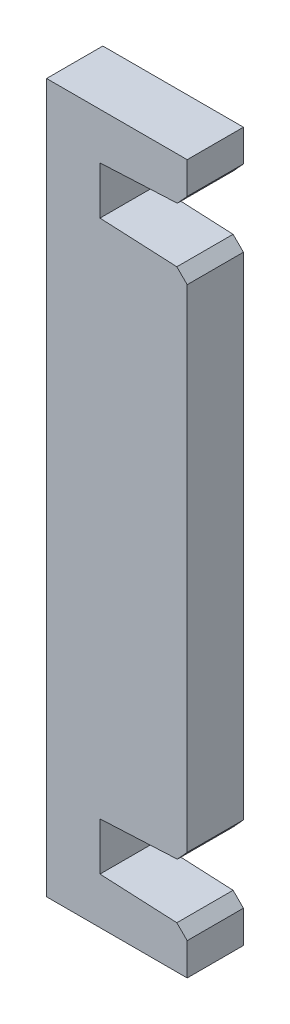
ISO-10303-21;
HEADER;
FILE_DESCRIPTION(('STEP AP214'),'2;1');
FILE_NAME('part.step','',(''),(''),'','','');
FILE_SCHEMA(('AUTOMOTIVE_DESIGN { 1 0 10303 214 1 1 1 1 }'));
ENDSEC;
DATA;
#1=APPLICATION_CONTEXT('core data for automotive mechanical design processes');
#2=APPLICATION_PROTOCOL_DEFINITION('international standard','automotive_design',2000,#1);
#3=PRODUCT_CONTEXT('',#1,'mechanical');
#4=PRODUCT('Part','Part','',(#3));
#5=PRODUCT_RELATED_PRODUCT_CATEGORY('part','',(#4));
#6=PRODUCT_DEFINITION_FORMATION('','',#4);
#7=PRODUCT_DEFINITION_CONTEXT('part definition',#1,'design');
#8=PRODUCT_DEFINITION('design','',#6,#7);
#9=PRODUCT_DEFINITION_SHAPE('','',#8);
#10=(LENGTH_UNIT() NAMED_UNIT(*) SI_UNIT(.MILLI.,.METRE.));
#11=(NAMED_UNIT(*) PLANE_ANGLE_UNIT() SI_UNIT($,.RADIAN.));
#12=(NAMED_UNIT(*) SI_UNIT($,.STERADIAN.) SOLID_ANGLE_UNIT());
#13=UNCERTAINTY_MEASURE_WITH_UNIT(LENGTH_MEASURE(1.E-05),#10,'distance_accuracy_value','');
#14=(GEOMETRIC_REPRESENTATION_CONTEXT(3) GLOBAL_UNCERTAINTY_ASSIGNED_CONTEXT((#13)) GLOBAL_UNIT_ASSIGNED_CONTEXT((#10,
#11,#12)) REPRESENTATION_CONTEXT('',''));
#15=CARTESIAN_POINT('',(0.,0.,0.));
#16=DIRECTION('',(0.,0.,1.));
#17=DIRECTION('',(1.,0.,0.));
#18=AXIS2_PLACEMENT_3D('',#15,#16,#17);
#19=CARTESIAN_POINT('',(-10.,0.,4.));
#20=DIRECTION('',(1.,0.,0.));
#21=DIRECTION('',(0.,0.,-1.));
#22=AXIS2_PLACEMENT_3D('',#19,#20,#21);
#23=PLANE('',#22);
#24=DIRECTION('',(0.,-1.,0.));
#25=VECTOR('',#24,1.);
#26=CARTESIAN_POINT('',(-10.,0.,0.));
#27=LINE('',#26,#25);
#28=CARTESIAN_POINT('',(-10.,25.2,0.));
#29=VERTEX_POINT('',#28);
#30=CARTESIAN_POINT('',(-10.,-25.2,0.));
#31=VERTEX_POINT('',#30);
#32=EDGE_CURVE('E180',#29,#31,#27,.T.);
#33=ORIENTED_EDGE('',*,*,#32,.T.);
#34=DIRECTION('',(0.,0.,-1.));
#35=VECTOR('',#34,1.);
#36=CARTESIAN_POINT('',(-10.,-25.2,4.));
#37=LINE('',#36,#35);
#38=CARTESIAN_POINT('',(-10.,-25.2,4.));
#39=VERTEX_POINT('',#38);
#40=EDGE_CURVE('E178',#39,#31,#37,.T.);
#41=ORIENTED_EDGE('',*,*,#40,.F.);
#42=DIRECTION('',(0.,-1.,0.));
#43=VECTOR('',#42,1.);
#44=CARTESIAN_POINT('',(-10.,0.,4.));
#45=LINE('',#44,#43);
#46=CARTESIAN_POINT('',(-10.,25.2,4.));
#47=VERTEX_POINT('',#46);
#48=EDGE_CURVE('E162',#47,#39,#45,.T.);
#49=ORIENTED_EDGE('',*,*,#48,.F.);
#50=DIRECTION('',(0.,0.,-1.));
#51=VECTOR('',#50,1.);
#52=CARTESIAN_POINT('',(-10.,25.2,4.));
#53=LINE('',#52,#51);
#54=EDGE_CURVE('E229',#47,#29,#53,.T.);
#55=ORIENTED_EDGE('',*,*,#54,.T.);
#56=EDGE_LOOP('',(#33,#41,#49,#55));
#57=FACE_BOUND('',#56,.T.);
#58=ADVANCED_FACE('F48',(#57),#23,.F.);
#59=CARTESIAN_POINT('',(0.,-25.2,4.));
#60=DIRECTION('',(0.,-1.,0.));
#61=DIRECTION('',(0.,0.,-1.));
#62=AXIS2_PLACEMENT_3D('',#59,#60,#61);
#63=PLANE('',#62);
#64=DIRECTION('',(-1.,0.,0.));
#65=VECTOR('',#64,1.);
#66=CARTESIAN_POINT('',(0.,-25.2,0.));
#67=LINE('',#66,#65);
#68=CARTESIAN_POINT('',(0.,-25.2,0.));
#69=VERTEX_POINT('',#68);
#70=EDGE_CURVE('E232',#69,#31,#67,.T.);
#71=ORIENTED_EDGE('',*,*,#70,.F.);
#72=DIRECTION('',(0.,0.,-1.));
#73=VECTOR('',#72,1.);
#74=CARTESIAN_POINT('',(0.,-25.2,4.));
#75=LINE('',#74,#73);
#76=CARTESIAN_POINT('',(0.,-25.2,4.));
#77=VERTEX_POINT('',#76);
#78=EDGE_CURVE('E186',#77,#69,#75,.T.);
#79=ORIENTED_EDGE('',*,*,#78,.F.);
#80=DIRECTION('',(-1.,0.,0.));
#81=VECTOR('',#80,1.);
#82=CARTESIAN_POINT('',(0.,-25.2,4.));
#83=LINE('',#82,#81);
#84=EDGE_CURVE('E168',#77,#39,#83,.T.);
#85=ORIENTED_EDGE('',*,*,#84,.T.);
#86=ORIENTED_EDGE('',*,*,#40,.T.);
#87=EDGE_LOOP('',(#71,#79,#85,#86));
#88=FACE_BOUND('',#87,.T.);
#89=ADVANCED_FACE('F189',(#88),#63,.T.);
#90=CARTESIAN_POINT('',(0.,0.,4.));
#91=DIRECTION('',(1.,0.,0.));
#92=DIRECTION('',(0.,1.,0.));
#93=AXIS2_PLACEMENT_3D('',#90,#91,#92);
#94=PLANE('',#93);
#95=DIRECTION('',(0.,-1.,0.));
#96=VECTOR('',#95,1.);
#97=CARTESIAN_POINT('',(0.,0.,0.));
#98=LINE('',#97,#96);
#99=CARTESIAN_POINT('',(0.,-22.9,0.));
#100=VERTEX_POINT('',#99);
#101=EDGE_CURVE('E235',#100,#69,#98,.T.);
#102=ORIENTED_EDGE('',*,*,#101,.F.);
#103=DIRECTION('',(0.,0.,1.));
#104=VECTOR('',#103,1.);
#105=CARTESIAN_POINT('',(0.,-22.9,4.));
#106=LINE('',#105,#104);
#107=CARTESIAN_POINT('',(0.,-22.9,4.));
#108=VERTEX_POINT('',#107);
#109=EDGE_CURVE('E324',#100,#108,#106,.T.);
#110=ORIENTED_EDGE('',*,*,#109,.T.);
#111=DIRECTION('',(0.,-1.,0.));
#112=VECTOR('',#111,1.);
#113=CARTESIAN_POINT('',(0.,0.,4.));
#114=LINE('',#113,#112);
#115=EDGE_CURVE('E192',#108,#77,#114,.T.);
#116=ORIENTED_EDGE('',*,*,#115,.T.);
#117=ORIENTED_EDGE('',*,*,#78,.T.);
#118=EDGE_LOOP('',(#102,#110,#116,#117));
#119=FACE_BOUND('',#118,.T.);
#120=ADVANCED_FACE('F361',(#119),#94,.T.);
#121=CARTESIAN_POINT('',(-1.07168440176485,-22.1481443031404,4.));
#122=DIRECTION('',(0.0483305514233223,0.998831396082,0.));
#123=DIRECTION('',(-0.998831396082,0.0483305514233223,0.));
#124=AXIS2_PLACEMENT_3D('',#121,#122,#123);
#125=PLANE('',#124);
#126=DIRECTION('',(0.998831396082,-0.0483305514233223,0.));
#127=VECTOR('',#126,1.);
#128=CARTESIAN_POINT('',(-1.07168440176485,-22.1481443031404,4.));
#129=LINE('',#128,#127);
#130=CARTESIAN_POINT('',(-6.20000000000001,-21.9,4.));
#131=VERTEX_POINT('',#130);
#132=CARTESIAN_POINT('',(-0.735593220338887,-22.164406779661,4.));
#133=VERTEX_POINT('',#132);
#134=EDGE_CURVE('E198',#131,#133,#129,.T.);
#135=ORIENTED_EDGE('',*,*,#134,.T.);
#136=DIRECTION('',(0.,0.,-1.));
#137=VECTOR('',#136,1.);
#138=CARTESIAN_POINT('',(-0.735593220338887,-22.164406779661,4.));
#139=LINE('',#138,#137);
#140=CARTESIAN_POINT('',(-0.735593220338887,-22.164406779661,0.));
#141=VERTEX_POINT('',#140);
#142=EDGE_CURVE('E320',#133,#141,#139,.T.);
#143=ORIENTED_EDGE('',*,*,#142,.T.);
#144=DIRECTION('',(0.998831396082,-0.0483305514233223,0.));
#145=VECTOR('',#144,1.);
#146=CARTESIAN_POINT('',(-1.07168440176485,-22.1481443031404,0.));
#147=LINE('',#146,#145);
#148=CARTESIAN_POINT('',(-6.20000000000001,-21.9,0.));
#149=VERTEX_POINT('',#148);
#150=EDGE_CURVE('E238',#149,#141,#147,.T.);
#151=ORIENTED_EDGE('',*,*,#150,.F.);
#152=DIRECTION('',(0.,0.,-1.));
#153=VECTOR('',#152,1.);
#154=CARTESIAN_POINT('',(-6.20000000000001,-21.9,4.));
#155=LINE('',#154,#153);
#156=EDGE_CURVE('E284',#131,#149,#155,.T.);
#157=ORIENTED_EDGE('',*,*,#156,.F.);
#158=EDGE_LOOP('',(#135,#143,#151,#157));
#159=FACE_BOUND('',#158,.T.);
#160=ADVANCED_FACE('F417',(#159),#125,.T.);
#161=CARTESIAN_POINT('',(-6.19999999999992,0.,4.));
#162=DIRECTION('',(1.,0.,0.));
#163=DIRECTION('',(0.,1.,0.));
#164=AXIS2_PLACEMENT_3D('',#161,#162,#163);
#165=PLANE('',#164);
#166=DIRECTION('',(0.,-1.,0.));
#167=VECTOR('',#166,1.);
#168=CARTESIAN_POINT('',(-6.19999999999992,0.,0.));
#169=LINE('',#168,#167);
#170=CARTESIAN_POINT('',(-6.2,-18.5,0.));
#171=VERTEX_POINT('',#170);
#172=EDGE_CURVE('E242',#171,#149,#169,.T.);
#173=ORIENTED_EDGE('',*,*,#172,.F.);
#174=DIRECTION('',(0.,0.,-1.));
#175=VECTOR('',#174,1.);
#176=CARTESIAN_POINT('',(-6.2,-18.5,4.));
#177=LINE('',#176,#175);
#178=CARTESIAN_POINT('',(-6.2,-18.5,4.));
#179=VERTEX_POINT('',#178);
#180=EDGE_CURVE('E280',#179,#171,#177,.T.);
#181=ORIENTED_EDGE('',*,*,#180,.F.);
#182=DIRECTION('',(0.,-1.,0.));
#183=VECTOR('',#182,1.);
#184=CARTESIAN_POINT('',(-6.19999999999992,0.,4.));
#185=LINE('',#184,#183);
#186=EDGE_CURVE('E204',#179,#131,#185,.T.);
#187=ORIENTED_EDGE('',*,*,#186,.T.);
#188=ORIENTED_EDGE('',*,*,#156,.T.);
#189=EDGE_LOOP('',(#173,#181,#187,#188));
#190=FACE_BOUND('',#189,.T.);
#191=ADVANCED_FACE('F413',(#190),#165,.T.);
#192=CARTESIAN_POINT('',(0.878588113158564,-18.1574876719439,4.));
#193=DIRECTION('',(0.0483305514233218,-0.998831396082,0.));
#194=DIRECTION('',(0.998831396082,0.0483305514233218,0.));
#195=AXIS2_PLACEMENT_3D('',#192,#193,#194);
#196=PLANE('',#195);
#197=DIRECTION('',(-0.998831396082,-0.0483305514233218,0.));
#198=VECTOR('',#197,1.);
#199=CARTESIAN_POINT('',(0.878588113158564,-18.1574876719439,0.));
#200=LINE('',#199,#198);
#201=CARTESIAN_POINT('',(-0.699181977257394,-18.2338313859963,0.));
#202=VERTEX_POINT('',#201);
#203=EDGE_CURVE('E246',#202,#171,#200,.T.);
#204=ORIENTED_EDGE('',*,*,#203,.F.);
#205=DIRECTION('',(0.,0.,1.));
#206=VECTOR('',#205,1.);
#207=CARTESIAN_POINT('',(-0.699181977257393,-18.2338313859963,4.));
#208=LINE('',#207,#206);
#209=CARTESIAN_POINT('',(-0.699181977257394,-18.2338313859963,4.));
#210=VERTEX_POINT('',#209);
#211=EDGE_CURVE('E306',#202,#210,#208,.T.);
#212=ORIENTED_EDGE('',*,*,#211,.T.);
#213=DIRECTION('',(-0.998831396082,-0.0483305514233218,0.));
#214=VECTOR('',#213,1.);
#215=CARTESIAN_POINT('',(0.878588113158564,-18.1574876719439,4.));
#216=LINE('',#215,#214);
#217=EDGE_CURVE('E208',#210,#179,#216,.T.);
#218=ORIENTED_EDGE('',*,*,#217,.T.);
#219=ORIENTED_EDGE('',*,*,#180,.T.);
#220=EDGE_LOOP('',(#204,#212,#218,#219));
#221=FACE_BOUND('',#220,.T.);
#222=ADVANCED_FACE('F408',(#221),#196,.T.);
#223=CARTESIAN_POINT('',(0.,0.,4.));
#224=DIRECTION('',(-1.,0.,0.));
#225=DIRECTION('',(0.,-1.,0.));
#226=AXIS2_PLACEMENT_3D('',#223,#224,#225);
#227=PLANE('',#226);
#228=DIRECTION('',(0.,1.,0.));
#229=VECTOR('',#228,1.);
#230=CARTESIAN_POINT('',(0.,0.,4.));
#231=LINE('',#230,#229);
#232=CARTESIAN_POINT('',(0.,-17.4635461568145,4.));
#233=VERTEX_POINT('',#232);
#234=CARTESIAN_POINT('',(0.,17.5,4.));
#235=VERTEX_POINT('',#234);
#236=EDGE_CURVE('E211',#233,#235,#231,.T.);
#237=ORIENTED_EDGE('',*,*,#236,.F.);
#238=DIRECTION('',(0.,0.,-1.));
#239=VECTOR('',#238,1.);
#240=CARTESIAN_POINT('',(0.,-17.4635461568145,0.));
#241=LINE('',#240,#239);
#242=CARTESIAN_POINT('',(0.,-17.4635461568145,0.));
#243=VERTEX_POINT('',#242);
#244=EDGE_CURVE('E290',#233,#243,#241,.T.);
#245=ORIENTED_EDGE('',*,*,#244,.T.);
#246=DIRECTION('',(0.,1.,0.));
#247=VECTOR('',#246,1.);
#248=CARTESIAN_POINT('',(0.,0.,0.));
#249=LINE('',#248,#247);
#250=CARTESIAN_POINT('',(0.,17.5,0.));
#251=VERTEX_POINT('',#250);
#252=EDGE_CURVE('E249',#243,#251,#249,.T.);
#253=ORIENTED_EDGE('',*,*,#252,.T.);
#254=DIRECTION('',(0.,0.,1.));
#255=VECTOR('',#254,1.);
#256=CARTESIAN_POINT('',(0.,17.5,4.));
#257=LINE('',#256,#255);
#258=EDGE_CURVE('E185',#251,#235,#257,.T.);
#259=ORIENTED_EDGE('',*,*,#258,.T.);
#260=EDGE_LOOP('',(#237,#245,#253,#259));
#261=FACE_BOUND('',#260,.T.);
#262=ADVANCED_FACE('F402',(#261),#227,.F.);
#263=CARTESIAN_POINT('',(0.878588113158554,18.1574876719439,4.));
#264=DIRECTION('',(-0.0483305514233213,-0.998831396082,0.));
#265=DIRECTION('',(0.998831396082,-0.0483305514233213,0.));
#266=AXIS2_PLACEMENT_3D('',#263,#264,#265);
#267=PLANE('',#266);
#268=DIRECTION('',(-0.998831396082,0.0483305514233213,0.));
#269=VECTOR('',#268,1.);
#270=CARTESIAN_POINT('',(0.878588113158554,18.1574876719439,4.));
#271=LINE('',#270,#269);
#272=CARTESIAN_POINT('',(-0.735593220338985,18.235593220339,4.));
#273=VERTEX_POINT('',#272);
#274=CARTESIAN_POINT('',(-6.2,18.5,4.));
#275=VERTEX_POINT('',#274);
#276=EDGE_CURVE('E215',#273,#275,#271,.T.);
#277=ORIENTED_EDGE('',*,*,#276,.F.);
#278=DIRECTION('',(0.,0.,-1.));
#279=VECTOR('',#278,1.);
#280=CARTESIAN_POINT('',(-0.735593220338984,18.235593220339,4.));
#281=LINE('',#280,#279);
#282=CARTESIAN_POINT('',(-0.735593220338985,18.235593220339,0.));
#283=VERTEX_POINT('',#282);
#284=EDGE_CURVE('E327',#273,#283,#281,.T.);
#285=ORIENTED_EDGE('',*,*,#284,.T.);
#286=DIRECTION('',(-0.998831396082,0.0483305514233213,0.));
#287=VECTOR('',#286,1.);
#288=CARTESIAN_POINT('',(0.878588113158554,18.1574876719439,0.));
#289=LINE('',#288,#287);
#290=CARTESIAN_POINT('',(-6.2,18.5,0.));
#291=VERTEX_POINT('',#290);
#292=EDGE_CURVE('E253',#283,#291,#289,.T.);
#293=ORIENTED_EDGE('',*,*,#292,.T.);
#294=DIRECTION('',(0.,0.,-1.));
#295=VECTOR('',#294,1.);
#296=CARTESIAN_POINT('',(-6.2,18.5,4.));
#297=LINE('',#296,#295);
#298=EDGE_CURVE('E276',#275,#291,#297,.T.);
#299=ORIENTED_EDGE('',*,*,#298,.F.);
#300=EDGE_LOOP('',(#277,#285,#293,#299));
#301=FACE_BOUND('',#300,.T.);
#302=ADVANCED_FACE('F394',(#301),#267,.F.);
#303=CARTESIAN_POINT('',(-6.19999999999992,0.,4.));
#304=DIRECTION('',(-1.,0.,0.));
#305=DIRECTION('',(0.,-1.,0.));
#306=AXIS2_PLACEMENT_3D('',#303,#304,#305);
#307=PLANE('',#306);
#308=DIRECTION('',(0.,1.,0.));
#309=VECTOR('',#308,1.);
#310=CARTESIAN_POINT('',(-6.19999999999992,0.,0.));
#311=LINE('',#310,#309);
#312=CARTESIAN_POINT('',(-6.20000000000001,21.9,0.));
#313=VERTEX_POINT('',#312);
#314=EDGE_CURVE('E256',#291,#313,#311,.T.);
#315=ORIENTED_EDGE('',*,*,#314,.T.);
#316=DIRECTION('',(0.,0.,-1.));
#317=VECTOR('',#316,1.);
#318=CARTESIAN_POINT('',(-6.20000000000001,21.9,4.));
#319=LINE('',#318,#317);
#320=CARTESIAN_POINT('',(-6.20000000000001,21.9,4.));
#321=VERTEX_POINT('',#320);
#322=EDGE_CURVE('E272',#321,#313,#319,.T.);
#323=ORIENTED_EDGE('',*,*,#322,.F.);
#324=DIRECTION('',(0.,1.,0.));
#325=VECTOR('',#324,1.);
#326=CARTESIAN_POINT('',(-6.19999999999992,0.,4.));
#327=LINE('',#326,#325);
#328=EDGE_CURVE('E218',#275,#321,#327,.T.);
#329=ORIENTED_EDGE('',*,*,#328,.F.);
#330=ORIENTED_EDGE('',*,*,#298,.T.);
#331=EDGE_LOOP('',(#315,#323,#329,#330));
#332=FACE_BOUND('',#331,.T.);
#333=ADVANCED_FACE('F400',(#332),#307,.F.);
#334=CARTESIAN_POINT('',(-1.07168440176486,22.1481443031404,4.));
#335=DIRECTION('',(-0.0483305514233229,0.998831396082,0.));
#336=DIRECTION('',(-0.998831396082,-0.0483305514233229,0.));
#337=AXIS2_PLACEMENT_3D('',#334,#335,#336);
#338=PLANE('',#337);
#339=DIRECTION('',(0.998831396082,0.0483305514233228,0.));
#340=VECTOR('',#339,1.);
#341=CARTESIAN_POINT('',(-1.07168440176486,22.1481443031404,0.));
#342=LINE('',#341,#340);
#343=CARTESIAN_POINT('',(-0.699181977257423,22.1661686140037,0.));
#344=VERTEX_POINT('',#343);
#345=EDGE_CURVE('E259',#313,#344,#342,.T.);
#346=ORIENTED_EDGE('',*,*,#345,.T.);
#347=DIRECTION('',(0.,0.,1.));
#348=VECTOR('',#347,1.);
#349=CARTESIAN_POINT('',(-0.699181977257423,22.1661686140037,4.));
#350=LINE('',#349,#348);
#351=CARTESIAN_POINT('',(-0.699181977257423,22.1661686140037,4.));
#352=VERTEX_POINT('',#351);
#353=EDGE_CURVE('E11',#344,#352,#350,.T.);
#354=ORIENTED_EDGE('',*,*,#353,.T.);
#355=DIRECTION('',(0.998831396082,0.0483305514233228,0.));
#356=VECTOR('',#355,1.);
#357=CARTESIAN_POINT('',(-1.07168440176486,22.1481443031404,4.));
#358=LINE('',#357,#356);
#359=EDGE_CURVE('E221',#321,#352,#358,.T.);
#360=ORIENTED_EDGE('',*,*,#359,.F.);
#361=ORIENTED_EDGE('',*,*,#322,.T.);
#362=EDGE_LOOP('',(#346,#354,#360,#361));
#363=FACE_BOUND('',#362,.T.);
#364=ADVANCED_FACE('F353',(#363),#338,.F.);
#365=CARTESIAN_POINT('',(0.,0.,4.));
#366=DIRECTION('',(-1.,0.,0.));
#367=DIRECTION('',(0.,-1.,0.));
#368=AXIS2_PLACEMENT_3D('',#365,#366,#367);
#369=PLANE('',#368);
#370=DIRECTION('',(0.,1.,0.));
#371=VECTOR('',#370,1.);
#372=CARTESIAN_POINT('',(0.,0.,4.));
#373=LINE('',#372,#371);
#374=CARTESIAN_POINT('',(1.09909990088711E-13,22.9364538431857,4.));
#375=VERTEX_POINT('',#374);
#376=CARTESIAN_POINT('',(1.20756755563519E-13,25.2,4.));
#377=VERTEX_POINT('',#376);
#378=EDGE_CURVE('E224',#375,#377,#373,.T.);
#379=ORIENTED_EDGE('',*,*,#378,.F.);
#380=DIRECTION('',(0.,0.,-1.));
#381=VECTOR('',#380,1.);
#382=CARTESIAN_POINT('',(1.09909990088711E-13,22.9364538431857,4.));
#383=LINE('',#382,#381);
#384=CARTESIAN_POINT('',(1.09909990088711E-13,22.9364538431857,0.));
#385=VERTEX_POINT('',#384);
#386=EDGE_CURVE('E58',#375,#385,#383,.T.);
#387=ORIENTED_EDGE('',*,*,#386,.T.);
#388=DIRECTION('',(0.,1.,0.));
#389=VECTOR('',#388,1.);
#390=CARTESIAN_POINT('',(0.,0.,0.));
#391=LINE('',#390,#389);
#392=CARTESIAN_POINT('',(1.20756755563519E-13,25.2,0.));
#393=VERTEX_POINT('',#392);
#394=EDGE_CURVE('E261',#385,#393,#391,.T.);
#395=ORIENTED_EDGE('',*,*,#394,.T.);
#396=DIRECTION('',(0.,0.,-1.));
#397=VECTOR('',#396,1.);
#398=CARTESIAN_POINT('',(1.20756755563519E-13,25.2,4.));
#399=LINE('',#398,#397);
#400=EDGE_CURVE('E268',#377,#393,#399,.T.);
#401=ORIENTED_EDGE('',*,*,#400,.F.);
#402=EDGE_LOOP('',(#379,#387,#395,#401));
#403=FACE_BOUND('',#402,.T.);
#404=ADVANCED_FACE('F336',(#403),#369,.F.);
#405=CARTESIAN_POINT('',(0.,25.2,4.));
#406=DIRECTION('',(0.,-1.,0.));
#407=DIRECTION('',(0.,0.,-1.));
#408=AXIS2_PLACEMENT_3D('',#405,#406,#407);
#409=PLANE('',#408);
#410=DIRECTION('',(-1.,0.,0.));
#411=VECTOR('',#410,1.);
#412=CARTESIAN_POINT('',(0.,25.2,0.));
#413=LINE('',#412,#411);
#414=EDGE_CURVE('E175',#393,#29,#413,.T.);
#415=ORIENTED_EDGE('',*,*,#414,.T.);
#416=ORIENTED_EDGE('',*,*,#54,.F.);
#417=DIRECTION('',(-1.,0.,0.));
#418=VECTOR('',#417,1.);
#419=CARTESIAN_POINT('',(0.,25.2,4.));
#420=LINE('',#419,#418);
#421=EDGE_CURVE('E170',#377,#47,#420,.T.);
#422=ORIENTED_EDGE('',*,*,#421,.F.);
#423=ORIENTED_EDGE('',*,*,#400,.T.);
#424=EDGE_LOOP('',(#415,#416,#422,#423));
#425=FACE_BOUND('',#424,.T.);
#426=ADVANCED_FACE('F345',(#425),#409,.F.);
#427=CARTESIAN_POINT('',(0.,0.,4.));
#428=DIRECTION('',(0.,0.,1.));
#429=DIRECTION('',(1.,0.,0.));
#430=AXIS2_PLACEMENT_3D('',#427,#428,#429);
#431=PLANE('',#430);
#432=ORIENTED_EDGE('',*,*,#217,.F.);
#433=DIRECTION('',(0.672105592781694,0.740455314081524,0.));
#434=VECTOR('',#433,1.);
#435=CARTESIAN_POINT('',(8.69098099031709,-7.88873659121093,4.));
#436=LINE('',#435,#434);
#437=EDGE_CURVE('E317',#210,#233,#436,.T.);
#438=ORIENTED_EDGE('',*,*,#437,.T.);
#439=ORIENTED_EDGE('',*,*,#236,.T.);
#440=DIRECTION('',(0.707106781186543,-0.707106781186553,0.));
#441=VECTOR('',#440,1.);
#442=CARTESIAN_POINT('',(8.74999999999999,8.74999999999987,4.));
#443=LINE('',#442,#441);
#444=EDGE_CURVE('E311',#235,#273,#443,.F.);
#445=ORIENTED_EDGE('',*,*,#444,.T.);
#446=ORIENTED_EDGE('',*,*,#276,.T.);
#447=ORIENTED_EDGE('',*,*,#328,.T.);
#448=ORIENTED_EDGE('',*,*,#359,.T.);
#449=DIRECTION('',(-0.672105592781692,-0.740455314081525,0.));
#450=VECTOR('',#449,1.);
#451=CARTESIAN_POINT('',(-11.4146509847673,10.3609908938657,4.));
#452=LINE('',#451,#450);
#453=EDGE_CURVE('E65',#352,#375,#452,.F.);
#454=ORIENTED_EDGE('',*,*,#453,.T.);
#455=ORIENTED_EDGE('',*,*,#378,.T.);
#456=ORIENTED_EDGE('',*,*,#421,.T.);
#457=ORIENTED_EDGE('',*,*,#48,.T.);
#458=ORIENTED_EDGE('',*,*,#84,.F.);
#459=ORIENTED_EDGE('',*,*,#115,.F.);
#460=DIRECTION('',(0.707106781186548,-0.707106781186548,0.));
#461=VECTOR('',#460,1.);
#462=CARTESIAN_POINT('',(-11.45,-11.45,4.));
#463=LINE('',#462,#461);
#464=EDGE_CURVE('E314',#108,#133,#463,.F.);
#465=ORIENTED_EDGE('',*,*,#464,.T.);
#466=ORIENTED_EDGE('',*,*,#134,.F.);
#467=ORIENTED_EDGE('',*,*,#186,.F.);
#468=EDGE_LOOP('',(#432,#438,#439,#445,#446,#447,#448,#454,#455,#456,#457,#458,#459,#465,#466,#467));
#469=FACE_BOUND('',#468,.T.);
#470=ADVANCED_FACE('F165',(#469),#431,.T.);
#471=CARTESIAN_POINT('',(0.,0.,0.));
#472=DIRECTION('',(0.,0.,1.));
#473=DIRECTION('',(1.,0.,0.));
#474=AXIS2_PLACEMENT_3D('',#471,#472,#473);
#475=PLANE('',#474);
#476=ORIENTED_EDGE('',*,*,#252,.F.);
#477=DIRECTION('',(-0.672105592781694,-0.740455314081524,0.));
#478=VECTOR('',#477,1.);
#479=CARTESIAN_POINT('',(0.,-17.4635461568145,0.));
#480=LINE('',#479,#478);
#481=EDGE_CURVE('E303',#243,#202,#480,.T.);
#482=ORIENTED_EDGE('',*,*,#481,.T.);
#483=ORIENTED_EDGE('',*,*,#203,.T.);
#484=ORIENTED_EDGE('',*,*,#172,.T.);
#485=ORIENTED_EDGE('',*,*,#150,.T.);
#486=DIRECTION('',(-0.707106781186548,0.707106781186548,0.));
#487=VECTOR('',#486,1.);
#488=CARTESIAN_POINT('',(-0.735593220338887,-22.164406779661,0.));
#489=LINE('',#488,#487);
#490=EDGE_CURVE('E300',#141,#100,#489,.F.);
#491=ORIENTED_EDGE('',*,*,#490,.T.);
#492=ORIENTED_EDGE('',*,*,#101,.T.);
#493=ORIENTED_EDGE('',*,*,#70,.T.);
#494=ORIENTED_EDGE('',*,*,#32,.F.);
#495=ORIENTED_EDGE('',*,*,#414,.F.);
#496=ORIENTED_EDGE('',*,*,#394,.F.);
#497=DIRECTION('',(0.672105592781692,0.740455314081525,0.));
#498=VECTOR('',#497,1.);
#499=CARTESIAN_POINT('',(1.09909990088711E-13,22.9364538431857,0.));
#500=LINE('',#499,#498);
#501=EDGE_CURVE('E294',#385,#344,#500,.F.);
#502=ORIENTED_EDGE('',*,*,#501,.T.);
#503=ORIENTED_EDGE('',*,*,#345,.F.);
#504=ORIENTED_EDGE('',*,*,#314,.F.);
#505=ORIENTED_EDGE('',*,*,#292,.F.);
#506=DIRECTION('',(-0.707106781186543,0.707106781186553,0.));
#507=VECTOR('',#506,1.);
#508=CARTESIAN_POINT('',(-0.735593220338984,18.235593220339,0.));
#509=LINE('',#508,#507);
#510=EDGE_CURVE('E297',#283,#251,#509,.F.);
#511=ORIENTED_EDGE('',*,*,#510,.T.);
#512=EDGE_LOOP('',(#476,#482,#483,#484,#485,#491,#492,#493,#494,#495,#496,#502,#503,#504,#505,#511));
#513=FACE_BOUND('',#512,.T.);
#514=ADVANCED_FACE('F342',(#513),#475,.F.);
#515=CARTESIAN_POINT('',(0.,-17.4635461568145,4.));
#516=DIRECTION('',(0.740455314081524,-0.672105592781694,0.));
#517=DIRECTION('',(0.,0.,1.));
#518=AXIS2_PLACEMENT_3D('',#515,#516,#517);
#519=PLANE('',#518);
#520=ORIENTED_EDGE('',*,*,#437,.F.);
#521=ORIENTED_EDGE('',*,*,#211,.F.);
#522=ORIENTED_EDGE('',*,*,#481,.F.);
#523=ORIENTED_EDGE('',*,*,#244,.F.);
#524=EDGE_LOOP('',(#520,#521,#522,#523));
#525=FACE_BOUND('',#524,.T.);
#526=ADVANCED_FACE('F366',(#525),#519,.T.);
#527=CARTESIAN_POINT('',(-0.735593220338887,-22.164406779661,4.));
#528=DIRECTION('',(-0.707106781186548,-0.707106781186548,0.));
#529=DIRECTION('',(0.,0.,-1.));
#530=AXIS2_PLACEMENT_3D('',#527,#528,#529);
#531=PLANE('',#530);
#532=ORIENTED_EDGE('',*,*,#464,.F.);
#533=ORIENTED_EDGE('',*,*,#109,.F.);
#534=ORIENTED_EDGE('',*,*,#490,.F.);
#535=ORIENTED_EDGE('',*,*,#142,.F.);
#536=EDGE_LOOP('',(#532,#533,#534,#535));
#537=FACE_BOUND('',#536,.T.);
#538=ADVANCED_FACE('F372',(#537),#531,.F.);
#539=CARTESIAN_POINT('',(-0.735593220338984,18.235593220339,4.));
#540=DIRECTION('',(-0.707106781186552,-0.707106781186542,0.));
#541=DIRECTION('',(0.,0.,-1.));
#542=AXIS2_PLACEMENT_3D('',#539,#540,#541);
#543=PLANE('',#542);
#544=ORIENTED_EDGE('',*,*,#444,.F.);
#545=ORIENTED_EDGE('',*,*,#258,.F.);
#546=ORIENTED_EDGE('',*,*,#510,.F.);
#547=ORIENTED_EDGE('',*,*,#284,.F.);
#548=EDGE_LOOP('',(#544,#545,#546,#547));
#549=FACE_BOUND('',#548,.T.);
#550=ADVANCED_FACE('F378',(#549),#543,.F.);
#551=CARTESIAN_POINT('',(1.09909990088711E-13,22.9364538431857,4.));
#552=DIRECTION('',(-0.740455314081525,0.672105592781692,0.));
#553=DIRECTION('',(0.,0.,-1.));
#554=AXIS2_PLACEMENT_3D('',#551,#552,#553);
#555=PLANE('',#554);
#556=ORIENTED_EDGE('',*,*,#453,.F.);
#557=ORIENTED_EDGE('',*,*,#353,.F.);
#558=ORIENTED_EDGE('',*,*,#501,.F.);
#559=ORIENTED_EDGE('',*,*,#386,.F.);
#560=EDGE_LOOP('',(#556,#557,#558,#559));
#561=FACE_BOUND('',#560,.T.);
#562=ADVANCED_FACE('F51',(#561),#555,.F.);
#563=CLOSED_SHELL('',(#58,#89,#120,#160,#191,#222,#262,#302,#333,#364,#404,#426,#470,#514,#526,
#538,#550,#562));
#564=MANIFOLD_SOLID_BREP('B2',#563);
#565=ADVANCED_BREP_SHAPE_REPRESENTATION('',(#18,#564),#14);
#566=SHAPE_DEFINITION_REPRESENTATION(#9,#565);
ENDSEC;
END-ISO-10303-21;
